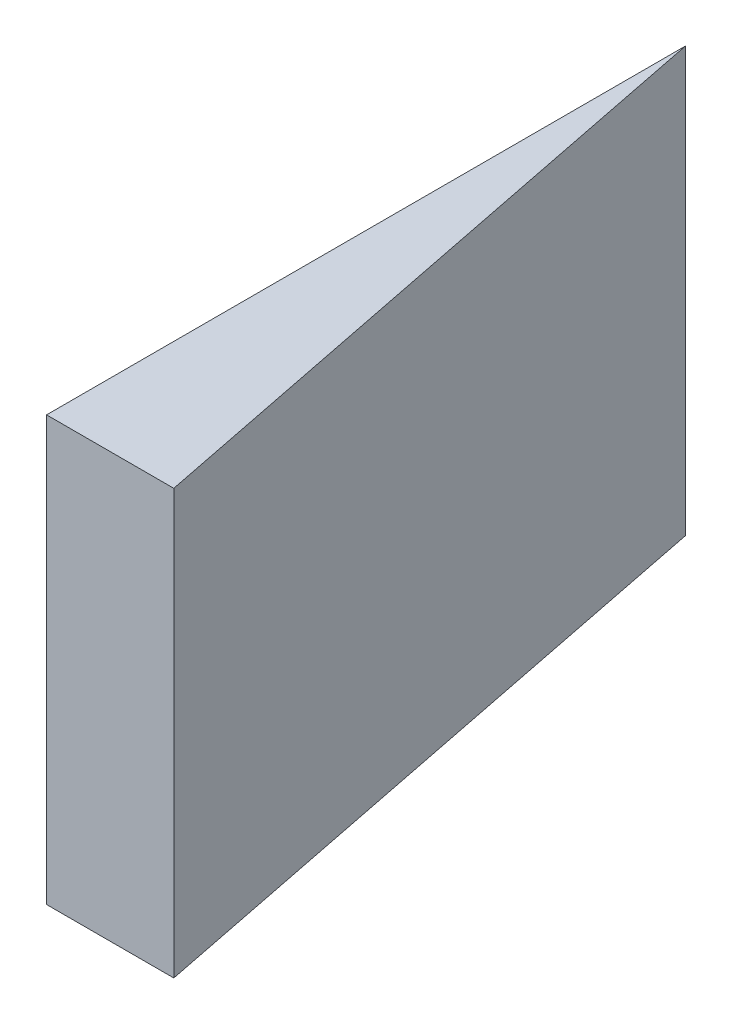
ISO-10303-21;
HEADER;
FILE_DESCRIPTION(('STEP AP214'),'2;1');
FILE_NAME('part.step','',(''),(''),'','','');
FILE_SCHEMA(('AUTOMOTIVE_DESIGN { 1 0 10303 214 1 1 1 1 }'));
ENDSEC;
DATA;
#1=APPLICATION_CONTEXT('core data for automotive mechanical design processes');
#2=APPLICATION_PROTOCOL_DEFINITION('international standard','automotive_design',2000,#1);
#3=PRODUCT_CONTEXT('',#1,'mechanical');
#4=PRODUCT('Part','Part','',(#3));
#5=PRODUCT_RELATED_PRODUCT_CATEGORY('part','',(#4));
#6=PRODUCT_DEFINITION_FORMATION('','',#4);
#7=PRODUCT_DEFINITION_CONTEXT('part definition',#1,'design');
#8=PRODUCT_DEFINITION('design','',#6,#7);
#9=PRODUCT_DEFINITION_SHAPE('','',#8);
#10=(LENGTH_UNIT() NAMED_UNIT(*) SI_UNIT(.MILLI.,.METRE.));
#11=(NAMED_UNIT(*) PLANE_ANGLE_UNIT() SI_UNIT($,.RADIAN.));
#12=(NAMED_UNIT(*) SI_UNIT($,.STERADIAN.) SOLID_ANGLE_UNIT());
#13=UNCERTAINTY_MEASURE_WITH_UNIT(LENGTH_MEASURE(1.E-05),#10,'distance_accuracy_value','');
#14=(GEOMETRIC_REPRESENTATION_CONTEXT(3) GLOBAL_UNCERTAINTY_ASSIGNED_CONTEXT((#13)) GLOBAL_UNIT_ASSIGNED_CONTEXT((#10,
#11,#12)) REPRESENTATION_CONTEXT('',''));
#15=CARTESIAN_POINT('',(0.,0.,0.));
#16=DIRECTION('',(0.,0.,1.));
#17=DIRECTION('',(1.,0.,0.));
#18=AXIS2_PLACEMENT_3D('',#15,#16,#17);
#19=CARTESIAN_POINT('',(3.37532201228971,1.74999936453267,-5.23287720051423));
#20=DIRECTION('',(1.74845553146952E-07,1.,8.74227765734759E-08));
#21=DIRECTION('',(-1.,1.74845553146952E-07,0.));
#22=AXIS2_PLACEMENT_3D('',#19,#20,#21);
#23=PLANE('',#22);
#24=DIRECTION('',(-0.195310522456604,1.19888317433476E-07,-0.980741454114036));
#25=VECTOR('',#24,1.);
#26=CARTESIAN_POINT('',(3.30000030597969,1.74999923942084,-3.65112136800624));
#27=LINE('',#26,#25);
#28=CARTESIAN_POINT('',(3.30000030597969,1.74999923941984,-3.65112136800723));
#29=VERTEX_POINT('',#28);
#30=CARTESIAN_POINT('',(3.00000030597971,1.74999942357016,-5.15755549420324));
#31=VERTEX_POINT('',#30);
#32=EDGE_CURVE('E11',#29,#31,#27,.T.);
#33=ORIENTED_EDGE('',*,*,#32,.T.);
#34=DIRECTION('',(0.,-8.74227765663743E-08,0.999999999999996));
#35=VECTOR('',#34,1.);
#36=CARTESIAN_POINT('',(3.00000030597971,1.74999942357116,-5.15755549420423));
#37=LINE('',#36,#35);
#38=CARTESIAN_POINT('',(3.00000030597969,1.74999929187351,-3.65112136800623));
#39=VERTEX_POINT('',#38);
#40=EDGE_CURVE('E49',#31,#39,#37,.T.);
#41=ORIENTED_EDGE('',*,*,#40,.T.);
#42=DIRECTION('',(0.999999999999985,-1.74845553591038E-07,0.));
#43=VECTOR('',#42,1.);
#44=CARTESIAN_POINT('',(3.00000030597969,1.74999929187451,-3.65112136800623));
#45=LINE('',#44,#43);
#46=EDGE_CURVE('E47',#39,#29,#45,.T.);
#47=ORIENTED_EDGE('',*,*,#46,.T.);
#48=EDGE_LOOP('',(#33,#41,#47));
#49=FACE_BOUND('',#48,.T.);
#50=ADVANCED_FACE('F17',(#49),#23,.T.);
#51=CARTESIAN_POINT('',(3.37532183744416,0.749999364532665,-5.23287728793701));
#52=DIRECTION('',(1.74845553146952E-07,1.,8.74227765734759E-08));
#53=DIRECTION('',(-1.,1.74845553146952E-07,0.));
#54=AXIS2_PLACEMENT_3D('',#51,#52,#53);
#55=PLANE('',#54);
#56=DIRECTION('',(0.999999999999985,-1.7484555285089E-07,0.));
#57=VECTOR('',#56,1.);
#58=CARTESIAN_POINT('',(3.00000013113413,0.74999929187451,-3.65112145542901));
#59=LINE('',#58,#57);
#60=CARTESIAN_POINT('',(3.00000013113413,0.74999929187551,-3.65112145542901));
#61=VERTEX_POINT('',#60);
#62=CARTESIAN_POINT('',(3.30000013113413,0.749999239421844,-3.65112145543001));
#63=VERTEX_POINT('',#62);
#64=EDGE_CURVE('E24',#61,#63,#59,.T.);
#65=ORIENTED_EDGE('',*,*,#64,.F.);
#66=DIRECTION('',(0.,-8.74227765663743E-08,0.999999999999996));
#67=VECTOR('',#66,1.);
#68=CARTESIAN_POINT('',(3.00000013113416,0.749999423571164,-5.15755558162701));
#69=LINE('',#68,#67);
#70=CARTESIAN_POINT('',(3.00000013113416,0.749999423572164,-5.15755558162601));
#71=VERTEX_POINT('',#70);
#72=EDGE_CURVE('E53',#71,#61,#69,.T.);
#73=ORIENTED_EDGE('',*,*,#72,.F.);
#74=DIRECTION('',(-0.195310522456603,1.19888317288917E-07,-0.980741454114036));
#75=VECTOR('',#74,1.);
#76=CARTESIAN_POINT('',(3.30000013113413,0.749999239420844,-3.65112145542901));
#77=LINE('',#76,#75);
#78=EDGE_CURVE('E68',#63,#71,#77,.T.);
#79=ORIENTED_EDGE('',*,*,#78,.F.);
#80=EDGE_LOOP('',(#65,#73,#79));
#81=FACE_BOUND('',#80,.T.);
#82=ADVANCED_FACE('F73',(#81),#55,.F.);
#83=CARTESIAN_POINT('',(3.30000030597969,1.74999923942084,-3.65112136800623));
#84=DIRECTION('',(-0.980741454114044,1.54403693849392E-07,0.195310522456619));
#85=DIRECTION('',(-0.195310522456604,1.19888317353705E-07,-0.980741454114041));
#86=AXIS2_PLACEMENT_3D('',#83,#84,#85);
#87=PLANE('',#86);
#88=DIRECTION('',(-1.74845553146948E-07,-0.999999999999981,-8.74227765734742E-08));
#89=VECTOR('',#88,1.);
#90=CARTESIAN_POINT('',(3.30000030597969,1.74999923942084,-3.65112136800623));
#91=LINE('',#90,#89);
#92=EDGE_CURVE('E59',#29,#63,#91,.T.);
#93=ORIENTED_EDGE('',*,*,#92,.T.);
#94=ORIENTED_EDGE('',*,*,#78,.T.);
#95=DIRECTION('',(-1.74845553146948E-07,-0.999999999999981,-8.74227765734742E-08));
#96=VECTOR('',#95,1.);
#97=CARTESIAN_POINT('',(3.00000030597971,1.74999942357116,-5.15755549420424));
#98=LINE('',#97,#96);
#99=EDGE_CURVE('E54',#31,#71,#98,.T.);
#100=ORIENTED_EDGE('',*,*,#99,.F.);
#101=ORIENTED_EDGE('',*,*,#32,.F.);
#102=EDGE_LOOP('',(#93,#94,#100,#101));
#103=FACE_BOUND('',#102,.T.);
#104=ADVANCED_FACE('F57',(#103),#87,.F.);
#105=CARTESIAN_POINT('',(3.00000030597971,1.74999942357116,-5.15755549420424));
#106=DIRECTION('',(1.,-1.74845553146952E-07,0.));
#107=DIRECTION('',(0.,-8.74227765734759E-08,1.));
#108=AXIS2_PLACEMENT_3D('',#105,#106,#107);
#109=PLANE('',#108);
#110=ORIENTED_EDGE('',*,*,#99,.T.);
#111=ORIENTED_EDGE('',*,*,#72,.T.);
#112=DIRECTION('',(-1.74845553146948E-07,-0.999999999999981,-8.74227765734742E-08));
#113=VECTOR('',#112,1.);
#114=CARTESIAN_POINT('',(3.00000030597969,1.74999929187451,-3.65112136800623));
#115=LINE('',#114,#113);
#116=EDGE_CURVE('E70',#39,#61,#115,.T.);
#117=ORIENTED_EDGE('',*,*,#116,.F.);
#118=ORIENTED_EDGE('',*,*,#40,.F.);
#119=EDGE_LOOP('',(#110,#111,#117,#118));
#120=FACE_BOUND('',#119,.T.);
#121=ADVANCED_FACE('F72',(#120),#109,.F.);
#122=CARTESIAN_POINT('',(3.00000030597969,1.74999929187451,-3.65112136800623));
#123=DIRECTION('',(0.,8.74227765734759E-08,-1.));
#124=DIRECTION('',(1.,-1.74845553146952E-07,0.));
#125=AXIS2_PLACEMENT_3D('',#122,#123,#124);
#126=PLANE('',#125);
#127=ORIENTED_EDGE('',*,*,#116,.T.);
#128=ORIENTED_EDGE('',*,*,#64,.T.);
#129=ORIENTED_EDGE('',*,*,#92,.F.);
#130=ORIENTED_EDGE('',*,*,#46,.F.);
#131=EDGE_LOOP('',(#127,#128,#129,#130));
#132=FACE_BOUND('',#131,.T.);
#133=ADVANCED_FACE('F61',(#132),#126,.F.);
#134=CLOSED_SHELL('',(#50,#82,#104,#121,#133));
#135=MANIFOLD_SOLID_BREP('B1',#134);
#136=ADVANCED_BREP_SHAPE_REPRESENTATION('',(#18,#135),#14);
#137=SHAPE_DEFINITION_REPRESENTATION(#9,#136);
ENDSEC;
END-ISO-10303-21;
